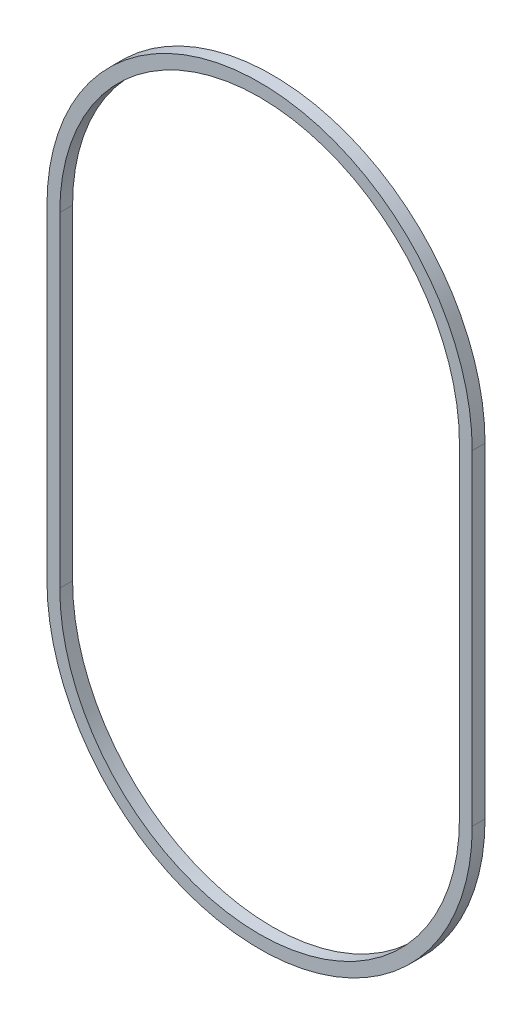
ISO-10303-21;
HEADER;
FILE_DESCRIPTION(('STEP AP214'),'2;1');
FILE_NAME('part.step','',(''),(''),'','','');
FILE_SCHEMA(('AUTOMOTIVE_DESIGN { 1 0 10303 214 1 1 1 1 }'));
ENDSEC;
DATA;
#1=APPLICATION_CONTEXT('core data for automotive mechanical design processes');
#2=APPLICATION_PROTOCOL_DEFINITION('international standard','automotive_design',2000,#1);
#3=PRODUCT_CONTEXT('',#1,'mechanical');
#4=PRODUCT('Part','Part','',(#3));
#5=PRODUCT_RELATED_PRODUCT_CATEGORY('part','',(#4));
#6=PRODUCT_DEFINITION_FORMATION('','',#4);
#7=PRODUCT_DEFINITION_CONTEXT('part definition',#1,'design');
#8=PRODUCT_DEFINITION('design','',#6,#7);
#9=PRODUCT_DEFINITION_SHAPE('','',#8);
#10=(LENGTH_UNIT() NAMED_UNIT(*) SI_UNIT(.MILLI.,.METRE.));
#11=(NAMED_UNIT(*) PLANE_ANGLE_UNIT() SI_UNIT($,.RADIAN.));
#12=(NAMED_UNIT(*) SI_UNIT($,.STERADIAN.) SOLID_ANGLE_UNIT());
#13=UNCERTAINTY_MEASURE_WITH_UNIT(LENGTH_MEASURE(1.E-05),#10,'distance_accuracy_value','');
#14=(GEOMETRIC_REPRESENTATION_CONTEXT(3) GLOBAL_UNCERTAINTY_ASSIGNED_CONTEXT((#13)) GLOBAL_UNIT_ASSIGNED_CONTEXT((#10,
#11,#12)) REPRESENTATION_CONTEXT('',''));
#15=CARTESIAN_POINT('',(0.,0.,0.));
#16=DIRECTION('',(0.,0.,1.));
#17=DIRECTION('',(1.,0.,0.));
#18=AXIS2_PLACEMENT_3D('',#15,#16,#17);
#19=CARTESIAN_POINT('',(0.,31.75,2.5));
#20=DIRECTION('',(0.,0.,1.));
#21=DIRECTION('',(1.,0.,0.));
#22=AXIS2_PLACEMENT_3D('',#19,#20,#21);
#23=PLANE('',#22);
#24=CARTESIAN_POINT('',(0.,31.75,2.5));
#25=DIRECTION('',(0.,0.,1.));
#26=DIRECTION('',(1.,0.,0.));
#27=AXIS2_PLACEMENT_3D('',#24,#25,#26);
#28=CIRCLE('',#27,41.5);
#29=CARTESIAN_POINT('',(41.5,31.75,2.5));
#30=VERTEX_POINT('',#29);
#31=CARTESIAN_POINT('',(-41.5,31.75,2.5));
#32=VERTEX_POINT('',#31);
#33=EDGE_CURVE('E157',#30,#32,#28,.T.);
#34=ORIENTED_EDGE('',*,*,#33,.T.);
#35=DIRECTION('',(0.,-1.,0.));
#36=VECTOR('',#35,1.);
#37=CARTESIAN_POINT('',(-41.5,31.75,2.5));
#38=LINE('',#37,#36);
#39=CARTESIAN_POINT('',(-41.5,-31.75,2.5));
#40=VERTEX_POINT('',#39);
#41=EDGE_CURVE('E161',#32,#40,#38,.T.);
#42=ORIENTED_EDGE('',*,*,#41,.T.);
#43=CARTESIAN_POINT('',(0.,-31.75,2.5));
#44=DIRECTION('',(0.,0.,1.));
#45=DIRECTION('',(1.,0.,0.));
#46=AXIS2_PLACEMENT_3D('',#43,#44,#45);
#47=CIRCLE('',#46,41.5);
#48=CARTESIAN_POINT('',(41.5,-31.75,2.5));
#49=VERTEX_POINT('',#48);
#50=EDGE_CURVE('E165',#40,#49,#47,.T.);
#51=ORIENTED_EDGE('',*,*,#50,.T.);
#52=DIRECTION('',(0.,1.,0.));
#53=VECTOR('',#52,1.);
#54=CARTESIAN_POINT('',(41.5,31.75,2.5));
#55=LINE('',#54,#53);
#56=EDGE_CURVE('E168',#49,#30,#55,.T.);
#57=ORIENTED_EDGE('',*,*,#56,.T.);
#58=EDGE_LOOP('',(#34,#42,#51,#57));
#59=FACE_BOUND('',#58,.T.);
#60=DIRECTION('',(0.,-1.,0.));
#61=VECTOR('',#60,1.);
#62=CARTESIAN_POINT('',(-39.,31.75,2.5));
#63=LINE('',#62,#61);
#64=CARTESIAN_POINT('',(-39.,31.75,2.5));
#65=VERTEX_POINT('',#64);
#66=CARTESIAN_POINT('',(-39.,-31.75,2.5));
#67=VERTEX_POINT('',#66);
#68=EDGE_CURVE('E118',#65,#67,#63,.T.);
#69=ORIENTED_EDGE('',*,*,#68,.F.);
#70=CARTESIAN_POINT('',(0.,31.75,2.5));
#71=DIRECTION('',(0.,0.,1.));
#72=DIRECTION('',(1.,0.,0.));
#73=AXIS2_PLACEMENT_3D('',#70,#71,#72);
#74=CIRCLE('',#73,39.);
#75=CARTESIAN_POINT('',(39.,31.75,2.5));
#76=VERTEX_POINT('',#75);
#77=EDGE_CURVE('E109',#76,#65,#74,.T.);
#78=ORIENTED_EDGE('',*,*,#77,.F.);
#79=DIRECTION('',(0.,1.,0.));
#80=VECTOR('',#79,1.);
#81=CARTESIAN_POINT('',(39.,31.75,2.5));
#82=LINE('',#81,#80);
#83=CARTESIAN_POINT('',(39.,-31.75,2.5));
#84=VERTEX_POINT('',#83);
#85=EDGE_CURVE('E135',#84,#76,#82,.T.);
#86=ORIENTED_EDGE('',*,*,#85,.F.);
#87=CARTESIAN_POINT('',(0.,-31.75,2.5));
#88=DIRECTION('',(0.,0.,1.));
#89=DIRECTION('',(1.,0.,0.));
#90=AXIS2_PLACEMENT_3D('',#87,#88,#89);
#91=CIRCLE('',#90,39.);
#92=EDGE_CURVE('E131',#67,#84,#91,.T.);
#93=ORIENTED_EDGE('',*,*,#92,.F.);
#94=EDGE_LOOP('',(#69,#78,#86,#93));
#95=FACE_BOUND('',#94,.T.);
#96=ADVANCED_FACE('F43',(#59,#95),#23,.T.);
#97=CARTESIAN_POINT('',(0.,31.75,0.));
#98=DIRECTION('',(0.,0.,1.));
#99=DIRECTION('',(1.,0.,0.));
#100=AXIS2_PLACEMENT_3D('',#97,#98,#99);
#101=PLANE('',#100);
#102=CARTESIAN_POINT('',(0.,31.75,0.));
#103=DIRECTION('',(0.,0.,1.));
#104=DIRECTION('',(1.,0.,0.));
#105=AXIS2_PLACEMENT_3D('',#102,#103,#104);
#106=CIRCLE('',#105,41.5);
#107=CARTESIAN_POINT('',(41.5,31.75,0.));
#108=VERTEX_POINT('',#107);
#109=CARTESIAN_POINT('',(-41.5,31.75,0.));
#110=VERTEX_POINT('',#109);
#111=EDGE_CURVE('E127',#108,#110,#106,.T.);
#112=ORIENTED_EDGE('',*,*,#111,.F.);
#113=DIRECTION('',(0.,1.,0.));
#114=VECTOR('',#113,1.);
#115=CARTESIAN_POINT('',(41.5,31.75,0.));
#116=LINE('',#115,#114);
#117=CARTESIAN_POINT('',(41.5,-31.75,0.));
#118=VERTEX_POINT('',#117);
#119=EDGE_CURVE('E162',#118,#108,#116,.T.);
#120=ORIENTED_EDGE('',*,*,#119,.F.);
#121=CARTESIAN_POINT('',(0.,-31.75,0.));
#122=DIRECTION('',(0.,0.,1.));
#123=DIRECTION('',(1.,0.,0.));
#124=AXIS2_PLACEMENT_3D('',#121,#122,#123);
#125=CIRCLE('',#124,41.5);
#126=CARTESIAN_POINT('',(-41.5,-31.75,0.));
#127=VERTEX_POINT('',#126);
#128=EDGE_CURVE('E178',#127,#118,#125,.T.);
#129=ORIENTED_EDGE('',*,*,#128,.F.);
#130=DIRECTION('',(0.,-1.,0.));
#131=VECTOR('',#130,1.);
#132=CARTESIAN_POINT('',(-41.5,31.75,0.));
#133=LINE('',#132,#131);
#134=EDGE_CURVE('E175',#110,#127,#133,.T.);
#135=ORIENTED_EDGE('',*,*,#134,.F.);
#136=EDGE_LOOP('',(#112,#120,#129,#135));
#137=FACE_BOUND('',#136,.T.);
#138=CARTESIAN_POINT('',(0.,31.75,0.));
#139=DIRECTION('',(0.,0.,1.));
#140=DIRECTION('',(1.,0.,0.));
#141=AXIS2_PLACEMENT_3D('',#138,#139,#140);
#142=CIRCLE('',#141,39.);
#143=CARTESIAN_POINT('',(39.,31.75,0.));
#144=VERTEX_POINT('',#143);
#145=CARTESIAN_POINT('',(-39.,31.75,0.));
#146=VERTEX_POINT('',#145);
#147=EDGE_CURVE('E67',#144,#146,#142,.T.);
#148=ORIENTED_EDGE('',*,*,#147,.T.);
#149=DIRECTION('',(0.,-1.,0.));
#150=VECTOR('',#149,1.);
#151=CARTESIAN_POINT('',(-39.,31.75,0.));
#152=LINE('',#151,#150);
#153=CARTESIAN_POINT('',(-39.,-31.75,0.));
#154=VERTEX_POINT('',#153);
#155=EDGE_CURVE('E125',#146,#154,#152,.T.);
#156=ORIENTED_EDGE('',*,*,#155,.T.);
#157=CARTESIAN_POINT('',(0.,-31.75,0.));
#158=DIRECTION('',(0.,0.,1.));
#159=DIRECTION('',(1.,0.,0.));
#160=AXIS2_PLACEMENT_3D('',#157,#158,#159);
#161=CIRCLE('',#160,39.);
#162=CARTESIAN_POINT('',(39.,-31.75,0.));
#163=VERTEX_POINT('',#162);
#164=EDGE_CURVE('E144',#154,#163,#161,.T.);
#165=ORIENTED_EDGE('',*,*,#164,.T.);
#166=DIRECTION('',(0.,1.,0.));
#167=VECTOR('',#166,1.);
#168=CARTESIAN_POINT('',(39.,31.75,0.));
#169=LINE('',#168,#167);
#170=EDGE_CURVE('E119',#163,#144,#169,.T.);
#171=ORIENTED_EDGE('',*,*,#170,.T.);
#172=EDGE_LOOP('',(#148,#156,#165,#171));
#173=FACE_BOUND('',#172,.T.);
#174=ADVANCED_FACE('F201',(#137,#173),#101,.F.);
#175=CARTESIAN_POINT('',(0.,31.75,2.5));
#176=DIRECTION('',(0.,0.,-1.));
#177=DIRECTION('',(-1.,0.,0.));
#178=AXIS2_PLACEMENT_3D('',#175,#176,#177);
#179=CYLINDRICAL_SURFACE('',#178,41.5);
#180=ORIENTED_EDGE('',*,*,#111,.T.);
#181=DIRECTION('',(0.,0.,-1.));
#182=VECTOR('',#181,1.);
#183=CARTESIAN_POINT('',(-41.5,31.75,2.5));
#184=LINE('',#183,#182);
#185=EDGE_CURVE('E11',#32,#110,#184,.T.);
#186=ORIENTED_EDGE('',*,*,#185,.F.);
#187=ORIENTED_EDGE('',*,*,#33,.F.);
#188=DIRECTION('',(0.,0.,-1.));
#189=VECTOR('',#188,1.);
#190=CARTESIAN_POINT('',(41.5,31.75,2.5));
#191=LINE('',#190,#189);
#192=EDGE_CURVE('E171',#30,#108,#191,.T.);
#193=ORIENTED_EDGE('',*,*,#192,.T.);
#194=EDGE_LOOP('',(#180,#186,#187,#193));
#195=FACE_BOUND('',#194,.T.);
#196=ADVANCED_FACE('F45',(#195),#179,.T.);
#197=CARTESIAN_POINT('',(-41.5,31.75,2.5));
#198=DIRECTION('',(1.,0.,0.));
#199=DIRECTION('',(0.,1.,0.));
#200=AXIS2_PLACEMENT_3D('',#197,#198,#199);
#201=PLANE('',#200);
#202=ORIENTED_EDGE('',*,*,#134,.T.);
#203=DIRECTION('',(0.,0.,-1.));
#204=VECTOR('',#203,1.);
#205=CARTESIAN_POINT('',(-41.5,-31.75,2.5));
#206=LINE('',#205,#204);
#207=EDGE_CURVE('E52',#40,#127,#206,.T.);
#208=ORIENTED_EDGE('',*,*,#207,.F.);
#209=ORIENTED_EDGE('',*,*,#41,.F.);
#210=ORIENTED_EDGE('',*,*,#185,.T.);
#211=EDGE_LOOP('',(#202,#208,#209,#210));
#212=FACE_BOUND('',#211,.T.);
#213=ADVANCED_FACE('F211',(#212),#201,.F.);
#214=CARTESIAN_POINT('',(0.,-31.75,2.5));
#215=DIRECTION('',(0.,0.,-1.));
#216=DIRECTION('',(-1.,0.,0.));
#217=AXIS2_PLACEMENT_3D('',#214,#215,#216);
#218=CYLINDRICAL_SURFACE('',#217,41.5);
#219=ORIENTED_EDGE('',*,*,#128,.T.);
#220=DIRECTION('',(0.,0.,-1.));
#221=VECTOR('',#220,1.);
#222=CARTESIAN_POINT('',(41.5,-31.75,2.5));
#223=LINE('',#222,#221);
#224=EDGE_CURVE('E186',#49,#118,#223,.T.);
#225=ORIENTED_EDGE('',*,*,#224,.F.);
#226=ORIENTED_EDGE('',*,*,#50,.F.);
#227=ORIENTED_EDGE('',*,*,#207,.T.);
#228=EDGE_LOOP('',(#219,#225,#226,#227));
#229=FACE_BOUND('',#228,.T.);
#230=ADVANCED_FACE('F195',(#229),#218,.T.);
#231=CARTESIAN_POINT('',(41.5,31.75,2.5));
#232=DIRECTION('',(-1.,0.,0.));
#233=DIRECTION('',(0.,-1.,0.));
#234=AXIS2_PLACEMENT_3D('',#231,#232,#233);
#235=PLANE('',#234);
#236=ORIENTED_EDGE('',*,*,#119,.T.);
#237=ORIENTED_EDGE('',*,*,#192,.F.);
#238=ORIENTED_EDGE('',*,*,#56,.F.);
#239=ORIENTED_EDGE('',*,*,#224,.T.);
#240=EDGE_LOOP('',(#236,#237,#238,#239));
#241=FACE_BOUND('',#240,.T.);
#242=ADVANCED_FACE('F205',(#241),#235,.F.);
#243=CARTESIAN_POINT('',(0.,31.75,2.5));
#244=DIRECTION('',(0.,0.,-1.));
#245=DIRECTION('',(-1.,0.,0.));
#246=AXIS2_PLACEMENT_3D('',#243,#244,#245);
#247=CYLINDRICAL_SURFACE('',#246,39.);
#248=ORIENTED_EDGE('',*,*,#147,.F.);
#249=DIRECTION('',(0.,0.,-1.));
#250=VECTOR('',#249,1.);
#251=CARTESIAN_POINT('',(39.,31.75,2.5));
#252=LINE('',#251,#250);
#253=EDGE_CURVE('E113',#76,#144,#252,.T.);
#254=ORIENTED_EDGE('',*,*,#253,.F.);
#255=ORIENTED_EDGE('',*,*,#77,.T.);
#256=DIRECTION('',(0.,0.,-1.));
#257=VECTOR('',#256,1.);
#258=CARTESIAN_POINT('',(-39.,31.75,2.5));
#259=LINE('',#258,#257);
#260=EDGE_CURVE('E112',#65,#146,#259,.T.);
#261=ORIENTED_EDGE('',*,*,#260,.T.);
#262=EDGE_LOOP('',(#248,#254,#255,#261));
#263=FACE_BOUND('',#262,.T.);
#264=ADVANCED_FACE('F111',(#263),#247,.F.);
#265=CARTESIAN_POINT('',(-39.,31.75,2.5));
#266=DIRECTION('',(1.,0.,0.));
#267=DIRECTION('',(0.,0.,-1.));
#268=AXIS2_PLACEMENT_3D('',#265,#266,#267);
#269=PLANE('',#268);
#270=ORIENTED_EDGE('',*,*,#155,.F.);
#271=ORIENTED_EDGE('',*,*,#260,.F.);
#272=ORIENTED_EDGE('',*,*,#68,.T.);
#273=DIRECTION('',(0.,0.,-1.));
#274=VECTOR('',#273,1.);
#275=CARTESIAN_POINT('',(-39.,-31.75,2.5));
#276=LINE('',#275,#274);
#277=EDGE_CURVE('E128',#67,#154,#276,.T.);
#278=ORIENTED_EDGE('',*,*,#277,.T.);
#279=EDGE_LOOP('',(#270,#271,#272,#278));
#280=FACE_BOUND('',#279,.T.);
#281=ADVANCED_FACE('F122',(#280),#269,.T.);
#282=CARTESIAN_POINT('',(0.,-31.75,2.5));
#283=DIRECTION('',(0.,0.,-1.));
#284=DIRECTION('',(-1.,0.,0.));
#285=AXIS2_PLACEMENT_3D('',#282,#283,#284);
#286=CYLINDRICAL_SURFACE('',#285,39.);
#287=ORIENTED_EDGE('',*,*,#164,.F.);
#288=ORIENTED_EDGE('',*,*,#277,.F.);
#289=ORIENTED_EDGE('',*,*,#92,.T.);
#290=DIRECTION('',(0.,0.,-1.));
#291=VECTOR('',#290,1.);
#292=CARTESIAN_POINT('',(39.,-31.75,2.5));
#293=LINE('',#292,#291);
#294=EDGE_CURVE('E59',#84,#163,#293,.T.);
#295=ORIENTED_EDGE('',*,*,#294,.T.);
#296=EDGE_LOOP('',(#287,#288,#289,#295));
#297=FACE_BOUND('',#296,.T.);
#298=ADVANCED_FACE('F234',(#297),#286,.F.);
#299=CARTESIAN_POINT('',(39.,31.75,2.5));
#300=DIRECTION('',(-1.,0.,0.));
#301=DIRECTION('',(0.,0.,1.));
#302=AXIS2_PLACEMENT_3D('',#299,#300,#301);
#303=PLANE('',#302);
#304=ORIENTED_EDGE('',*,*,#170,.F.);
#305=ORIENTED_EDGE('',*,*,#294,.F.);
#306=ORIENTED_EDGE('',*,*,#85,.T.);
#307=ORIENTED_EDGE('',*,*,#253,.T.);
#308=EDGE_LOOP('',(#304,#305,#306,#307));
#309=FACE_BOUND('',#308,.T.);
#310=ADVANCED_FACE('F238',(#309),#303,.T.);
#311=CLOSED_SHELL('',(#96,#174,#196,#213,#230,#242,#264,#281,#298,#310));
#312=MANIFOLD_SOLID_BREP('B2',#311);
#313=ADVANCED_BREP_SHAPE_REPRESENTATION('',(#18,#312),#14);
#314=SHAPE_DEFINITION_REPRESENTATION(#9,#313);
ENDSEC;
END-ISO-10303-21;
